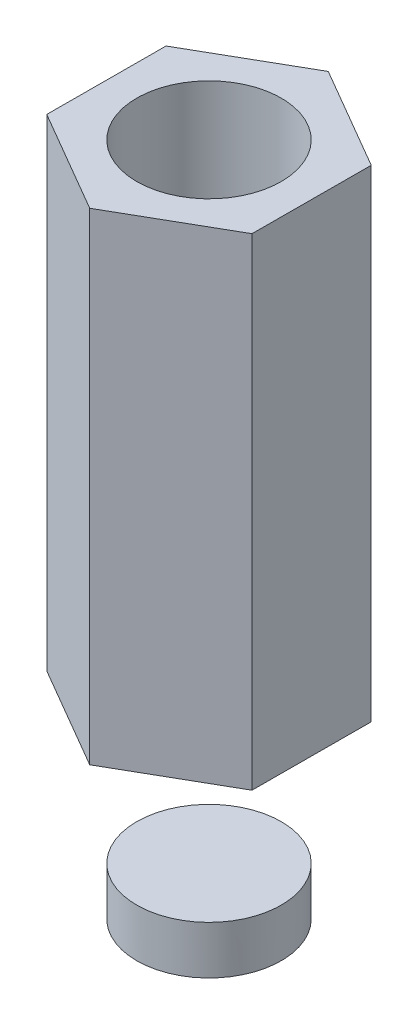
ISO-10303-21;
HEADER;
FILE_DESCRIPTION(('STEP AP214'),'2;1');
FILE_NAME('part.step','',(''),(''),'','','');
FILE_SCHEMA(('AUTOMOTIVE_DESIGN { 1 0 10303 214 1 1 1 1 }'));
ENDSEC;
DATA;
#1=APPLICATION_CONTEXT('core data for automotive mechanical design processes');
#2=APPLICATION_PROTOCOL_DEFINITION('international standard','automotive_design',2000,#1);
#3=PRODUCT_CONTEXT('',#1,'mechanical');
#4=PRODUCT('Part','Part','',(#3));
#5=PRODUCT_RELATED_PRODUCT_CATEGORY('part','',(#4));
#6=PRODUCT_DEFINITION_FORMATION('','',#4);
#7=PRODUCT_DEFINITION_CONTEXT('part definition',#1,'design');
#8=PRODUCT_DEFINITION('design','',#6,#7);
#9=PRODUCT_DEFINITION_SHAPE('','',#8);
#10=(LENGTH_UNIT() NAMED_UNIT(*) SI_UNIT(.MILLI.,.METRE.));
#11=(NAMED_UNIT(*) PLANE_ANGLE_UNIT() SI_UNIT($,.RADIAN.));
#12=(NAMED_UNIT(*) SI_UNIT($,.STERADIAN.) SOLID_ANGLE_UNIT());
#13=UNCERTAINTY_MEASURE_WITH_UNIT(LENGTH_MEASURE(1.E-05),#10,'distance_accuracy_value','');
#14=(GEOMETRIC_REPRESENTATION_CONTEXT(3) GLOBAL_UNCERTAINTY_ASSIGNED_CONTEXT((#13)) GLOBAL_UNIT_ASSIGNED_CONTEXT((#10,
#11,#12)) REPRESENTATION_CONTEXT('',''));
#15=CARTESIAN_POINT('',(0.,0.,0.));
#16=DIRECTION('',(0.,0.,1.));
#17=DIRECTION('',(1.,0.,0.));
#18=AXIS2_PLACEMENT_3D('',#15,#16,#17);
#19=CARTESIAN_POINT('',(0.,1.,0.));
#20=DIRECTION('',(0.,1.,0.));
#21=DIRECTION('',(-1.,0.,0.));
#22=AXIS2_PLACEMENT_3D('',#19,#20,#21);
#23=PLANE('',#22);
#24=CARTESIAN_POINT('',(0.,1.,0.));
#25=DIRECTION('',(0.,1.,0.));
#26=DIRECTION('',(-1.,0.,0.));
#27=AXIS2_PLACEMENT_3D('',#24,#25,#26);
#28=CIRCLE('',#27,1.5);
#29=CARTESIAN_POINT('',(-1.5,0.999999999999999,0.));
#30=VERTEX_POINT('',#29);
#31=EDGE_CURVE('E42',#30,#30,#28,.T.);
#32=ORIENTED_EDGE('',*,*,#31,.T.);
#33=EDGE_LOOP('',(#32));
#34=FACE_BOUND('',#33,.T.);
#35=ADVANCED_FACE('F39',(#34),#23,.T.);
#36=CARTESIAN_POINT('',(0.,0.,0.));
#37=DIRECTION('',(0.,1.,0.));
#38=DIRECTION('',(0.,0.,1.));
#39=AXIS2_PLACEMENT_3D('',#36,#37,#38);
#40=PLANE('',#39);
#41=CARTESIAN_POINT('',(0.,0.,0.));
#42=DIRECTION('',(0.,1.,0.));
#43=DIRECTION('',(0.,0.,1.));
#44=AXIS2_PLACEMENT_3D('',#41,#42,#43);
#45=CIRCLE('',#44,1.5);
#46=CARTESIAN_POINT('',(0.,0.,1.5));
#47=VERTEX_POINT('',#46);
#48=EDGE_CURVE('E11',#47,#47,#45,.T.);
#49=ORIENTED_EDGE('',*,*,#48,.F.);
#50=EDGE_LOOP('',(#49));
#51=FACE_BOUND('',#50,.T.);
#52=ADVANCED_FACE('F54',(#51),#40,.F.);
#53=CARTESIAN_POINT('',(0.,4.,0.));
#54=DIRECTION('',(0.,-1.,0.));
#55=DIRECTION('',(0.,0.,-1.));
#56=AXIS2_PLACEMENT_3D('',#53,#54,#55);
#57=CYLINDRICAL_SURFACE('',#56,1.5);
#58=ORIENTED_EDGE('',*,*,#48,.T.);
#59=EDGE_LOOP('',(#58));
#60=FACE_BOUND('',#59,.T.);
#61=ORIENTED_EDGE('',*,*,#31,.F.);
#62=EDGE_LOOP('',(#61));
#63=FACE_BOUND('',#62,.T.);
#64=ADVANCED_FACE('F52',(#60,#63),#57,.T.);
#65=CLOSED_SHELL('',(#35,#52,#64));
#66=MANIFOLD_SOLID_BREP('B2',#65);
#67=CARTESIAN_POINT('',(-2.13186599078324,4.,-1.24023650407198));
#68=DIRECTION('',(0.,1.,0.));
#69=DIRECTION('',(0.,0.,1.));
#70=AXIS2_PLACEMENT_3D('',#67,#68,#69);
#71=PLANE('',#70);
#72=DIRECTION('',(-0.867671547723485,0.,0.497137893618191));
#73=VECTOR('',#72,1.);
#74=CARTESIAN_POINT('',(0.00814332383552204,4.,-2.46636835751836));
#75=LINE('',#74,#73);
#76=CARTESIAN_POINT('',(0.00814332383552204,4.,-2.46636835751836));
#77=VERTEX_POINT('',#76);
#78=CARTESIAN_POINT('',(-2.13186599078324,4.,-1.24023650407198));
#79=VERTEX_POINT('',#78);
#80=EDGE_CURVE('E165',#77,#79,#75,.T.);
#81=ORIENTED_EDGE('',*,*,#80,.F.);
#82=DIRECTION('',(-0.864369818918982,0.,-0.502856655660404));
#83=VECTOR('',#82,1.);
#84=CARTESIAN_POINT('',(2.14000931461876,4.,-1.22613185344637));
#85=LINE('',#84,#83);
#86=CARTESIAN_POINT('',(2.14000931461876,4.,-1.22613185344637));
#87=VERTEX_POINT('',#86);
#88=EDGE_CURVE('E126',#87,#77,#85,.T.);
#89=ORIENTED_EDGE('',*,*,#88,.F.);
#90=DIRECTION('',(0.00330172880450263,0.,-0.999994549278596));
#91=VECTOR('',#90,1.);
#92=CARTESIAN_POINT('',(2.13186599078323,4.,1.24023650407198));
#93=LINE('',#92,#91);
#94=CARTESIAN_POINT('',(2.13186599078323,4.,1.24023650407198));
#95=VERTEX_POINT('',#94);
#96=EDGE_CURVE('E120',#95,#87,#93,.T.);
#97=ORIENTED_EDGE('',*,*,#96,.F.);
#98=DIRECTION('',(0.867671547723485,0.,-0.497137893618191));
#99=VECTOR('',#98,1.);
#100=CARTESIAN_POINT('',(-0.00814332383552226,4.,2.46636835751835));
#101=LINE('',#100,#99);
#102=CARTESIAN_POINT('',(-0.00814332383552226,4.,2.46636835751835));
#103=VERTEX_POINT('',#102);
#104=EDGE_CURVE('E155',#103,#95,#101,.T.);
#105=ORIENTED_EDGE('',*,*,#104,.F.);
#106=DIRECTION('',(0.864369818918982,0.,0.502856655660404));
#107=VECTOR('',#106,1.);
#108=CARTESIAN_POINT('',(-2.14000931461876,4.,1.22613185344637));
#109=LINE('',#108,#107);
#110=CARTESIAN_POINT('',(-2.14000931461876,4.,1.22613185344637));
#111=VERTEX_POINT('',#110);
#112=EDGE_CURVE('E171',#111,#103,#109,.T.);
#113=ORIENTED_EDGE('',*,*,#112,.F.);
#114=DIRECTION('',(-0.0033017288045028,0.,0.999994549278596));
#115=VECTOR('',#114,1.);
#116=CARTESIAN_POINT('',(-2.13186599078324,4.,-1.24023650407198));
#117=LINE('',#116,#115);
#118=EDGE_CURVE('E168',#79,#111,#117,.T.);
#119=ORIENTED_EDGE('',*,*,#118,.F.);
#120=EDGE_LOOP('',(#81,#89,#97,#105,#113,#119));
#121=FACE_BOUND('',#120,.T.);
#122=ADVANCED_FACE('F80',(#121),#71,.F.);
#123=CARTESIAN_POINT('',(0.00814332383552204,14.,-2.46636835751836));
#124=DIRECTION('',(0.497137893618191,0.,0.867671547723485));
#125=DIRECTION('',(0.867671547723485,0.,-0.497137893618191));
#126=AXIS2_PLACEMENT_3D('',#123,#124,#125);
#127=PLANE('',#126);
#128=ORIENTED_EDGE('',*,*,#80,.T.);
#129=DIRECTION('',(0.,-1.,0.));
#130=VECTOR('',#129,1.);
#131=CARTESIAN_POINT('',(-2.13186599078324,14.,-1.24023650407198));
#132=LINE('',#131,#130);
#133=CARTESIAN_POINT('',(-2.13186599078324,14.,-1.24023650407198));
#134=VERTEX_POINT('',#133);
#135=EDGE_CURVE('E37',#134,#79,#132,.T.);
#136=ORIENTED_EDGE('',*,*,#135,.F.);
#137=DIRECTION('',(-0.867671547723485,0.,0.497137893618191));
#138=VECTOR('',#137,1.);
#139=CARTESIAN_POINT('',(0.00814332383552204,14.,-2.46636835751836));
#140=LINE('',#139,#138);
#141=CARTESIAN_POINT('',(0.00814332383552204,14.,-2.46636835751836));
#142=VERTEX_POINT('',#141);
#143=EDGE_CURVE('E176',#142,#134,#140,.T.);
#144=ORIENTED_EDGE('',*,*,#143,.F.);
#145=DIRECTION('',(0.,-1.,0.));
#146=VECTOR('',#145,1.);
#147=CARTESIAN_POINT('',(0.00814332383552204,14.,-2.46636835751836));
#148=LINE('',#147,#146);
#149=EDGE_CURVE('E161',#142,#77,#148,.T.);
#150=ORIENTED_EDGE('',*,*,#149,.T.);
#151=EDGE_LOOP('',(#128,#136,#144,#150));
#152=FACE_BOUND('',#151,.T.);
#153=ADVANCED_FACE('F82',(#152),#127,.F.);
#154=CARTESIAN_POINT('',(-2.13186599078324,14.,-1.24023650407198));
#155=DIRECTION('',(0.999994549278596,0.,0.0033017288045028));
#156=DIRECTION('',(0.0033017288045028,0.,-0.999994549278596));
#157=AXIS2_PLACEMENT_3D('',#154,#155,#156);
#158=PLANE('',#157);
#159=ORIENTED_EDGE('',*,*,#118,.T.);
#160=DIRECTION('',(0.,-1.,0.));
#161=VECTOR('',#160,1.);
#162=CARTESIAN_POINT('',(-2.14000931461876,14.,1.22613185344637));
#163=LINE('',#162,#161);
#164=CARTESIAN_POINT('',(-2.14000931461876,14.,1.22613185344637));
#165=VERTEX_POINT('',#164);
#166=EDGE_CURVE('E89',#165,#111,#163,.T.);
#167=ORIENTED_EDGE('',*,*,#166,.F.);
#168=DIRECTION('',(-0.0033017288045028,0.,0.999994549278596));
#169=VECTOR('',#168,1.);
#170=CARTESIAN_POINT('',(-2.13186599078324,14.,-1.24023650407198));
#171=LINE('',#170,#169);
#172=EDGE_CURVE('E134',#134,#165,#171,.T.);
#173=ORIENTED_EDGE('',*,*,#172,.F.);
#174=ORIENTED_EDGE('',*,*,#135,.T.);
#175=EDGE_LOOP('',(#159,#167,#173,#174));
#176=FACE_BOUND('',#175,.T.);
#177=ADVANCED_FACE('F204',(#176),#158,.F.);
#178=CARTESIAN_POINT('',(-2.14000931461876,14.,1.22613185344637));
#179=DIRECTION('',(0.502856655660404,0.,-0.864369818918982));
#180=DIRECTION('',(-0.864369818918982,0.,-0.502856655660404));
#181=AXIS2_PLACEMENT_3D('',#178,#179,#180);
#182=PLANE('',#181);
#183=ORIENTED_EDGE('',*,*,#112,.T.);
#184=DIRECTION('',(0.,-1.,0.));
#185=VECTOR('',#184,1.);
#186=CARTESIAN_POINT('',(-0.00814332383552226,14.,2.46636835751835));
#187=LINE('',#186,#185);
#188=CARTESIAN_POINT('',(-0.00814332383552226,14.,2.46636835751835));
#189=VERTEX_POINT('',#188);
#190=EDGE_CURVE('E156',#189,#103,#187,.T.);
#191=ORIENTED_EDGE('',*,*,#190,.F.);
#192=DIRECTION('',(0.864369818918982,0.,0.502856655660404));
#193=VECTOR('',#192,1.);
#194=CARTESIAN_POINT('',(-2.14000931461876,14.,1.22613185344637));
#195=LINE('',#194,#193);
#196=EDGE_CURVE('E147',#165,#189,#195,.T.);
#197=ORIENTED_EDGE('',*,*,#196,.F.);
#198=ORIENTED_EDGE('',*,*,#166,.T.);
#199=EDGE_LOOP('',(#183,#191,#197,#198));
#200=FACE_BOUND('',#199,.T.);
#201=ADVANCED_FACE('F182',(#200),#182,.F.);
#202=CARTESIAN_POINT('',(-0.00814332383552226,14.,2.46636835751835));
#203=DIRECTION('',(-0.497137893618191,0.,-0.867671547723485));
#204=DIRECTION('',(-0.867671547723485,0.,0.497137893618191));
#205=AXIS2_PLACEMENT_3D('',#202,#203,#204);
#206=PLANE('',#205);
#207=ORIENTED_EDGE('',*,*,#104,.T.);
#208=DIRECTION('',(0.,-1.,0.));
#209=VECTOR('',#208,1.);
#210=CARTESIAN_POINT('',(2.13186599078323,14.,1.24023650407198));
#211=LINE('',#210,#209);
#212=CARTESIAN_POINT('',(2.13186599078323,14.,1.24023650407198));
#213=VERTEX_POINT('',#212);
#214=EDGE_CURVE('E152',#213,#95,#211,.T.);
#215=ORIENTED_EDGE('',*,*,#214,.F.);
#216=DIRECTION('',(0.867671547723485,0.,-0.497137893618191));
#217=VECTOR('',#216,1.);
#218=CARTESIAN_POINT('',(-0.00814332383552226,14.,2.46636835751835));
#219=LINE('',#218,#217);
#220=EDGE_CURVE('E141',#189,#213,#219,.T.);
#221=ORIENTED_EDGE('',*,*,#220,.F.);
#222=ORIENTED_EDGE('',*,*,#190,.T.);
#223=EDGE_LOOP('',(#207,#215,#221,#222));
#224=FACE_BOUND('',#223,.T.);
#225=ADVANCED_FACE('F153',(#224),#206,.F.);
#226=CARTESIAN_POINT('',(2.13186599078323,14.,1.24023650407198));
#227=DIRECTION('',(-0.999994549278596,0.,-0.00330172880450263));
#228=DIRECTION('',(-0.00330172880450263,0.,0.999994549278596));
#229=AXIS2_PLACEMENT_3D('',#226,#227,#228);
#230=PLANE('',#229);
#231=ORIENTED_EDGE('',*,*,#96,.T.);
#232=DIRECTION('',(0.,-1.,0.));
#233=VECTOR('',#232,1.);
#234=CARTESIAN_POINT('',(2.14000931461876,14.,-1.22613185344637));
#235=LINE('',#234,#233);
#236=CARTESIAN_POINT('',(2.14000931461876,14.,-1.22613185344637));
#237=VERTEX_POINT('',#236);
#238=EDGE_CURVE('E157',#237,#87,#235,.T.);
#239=ORIENTED_EDGE('',*,*,#238,.F.);
#240=DIRECTION('',(0.00330172880450263,0.,-0.999994549278596));
#241=VECTOR('',#240,1.);
#242=CARTESIAN_POINT('',(2.13186599078323,14.,1.24023650407198));
#243=LINE('',#242,#241);
#244=EDGE_CURVE('E145',#213,#237,#243,.T.);
#245=ORIENTED_EDGE('',*,*,#244,.F.);
#246=ORIENTED_EDGE('',*,*,#214,.T.);
#247=EDGE_LOOP('',(#231,#239,#245,#246));
#248=FACE_BOUND('',#247,.T.);
#249=ADVANCED_FACE('F159',(#248),#230,.F.);
#250=CARTESIAN_POINT('',(2.14000931461876,14.,-1.22613185344637));
#251=DIRECTION('',(-0.502856655660405,0.,0.864369818918982));
#252=DIRECTION('',(0.864369818918982,0.,0.502856655660405));
#253=AXIS2_PLACEMENT_3D('',#250,#251,#252);
#254=PLANE('',#253);
#255=ORIENTED_EDGE('',*,*,#88,.T.);
#256=ORIENTED_EDGE('',*,*,#149,.F.);
#257=DIRECTION('',(-0.864369818918982,0.,-0.502856655660404));
#258=VECTOR('',#257,1.);
#259=CARTESIAN_POINT('',(2.14000931461876,14.,-1.22613185344637));
#260=LINE('',#259,#258);
#261=EDGE_CURVE('E97',#237,#142,#260,.T.);
#262=ORIENTED_EDGE('',*,*,#261,.F.);
#263=ORIENTED_EDGE('',*,*,#238,.T.);
#264=EDGE_LOOP('',(#255,#256,#262,#263));
#265=FACE_BOUND('',#264,.T.);
#266=ADVANCED_FACE('F188',(#265),#254,.F.);
#267=CARTESIAN_POINT('',(-2.13186599078324,14.,-1.24023650407198));
#268=DIRECTION('',(0.,1.,0.));
#269=DIRECTION('',(0.,0.,1.));
#270=AXIS2_PLACEMENT_3D('',#267,#268,#269);
#271=PLANE('',#270);
#272=CARTESIAN_POINT('',(0.,14.,0.));
#273=DIRECTION('',(0.,1.,0.));
#274=DIRECTION('',(0.,0.,1.));
#275=AXIS2_PLACEMENT_3D('',#272,#273,#274);
#276=CIRCLE('',#275,1.5);
#277=CARTESIAN_POINT('',(0.,14.,1.5));
#278=VERTEX_POINT('',#277);
#279=EDGE_CURVE('E216',#278,#278,#276,.T.);
#280=ORIENTED_EDGE('',*,*,#279,.F.);
#281=EDGE_LOOP('',(#280));
#282=FACE_BOUND('',#281,.T.);
#283=ORIENTED_EDGE('',*,*,#143,.T.);
#284=ORIENTED_EDGE('',*,*,#172,.T.);
#285=ORIENTED_EDGE('',*,*,#196,.T.);
#286=ORIENTED_EDGE('',*,*,#220,.T.);
#287=ORIENTED_EDGE('',*,*,#244,.T.);
#288=ORIENTED_EDGE('',*,*,#261,.T.);
#289=EDGE_LOOP('',(#283,#284,#285,#286,#287,#288));
#290=FACE_BOUND('',#289,.T.);
#291=ADVANCED_FACE('F143',(#282,#290),#271,.T.);
#292=CARTESIAN_POINT('',(0.,10.,0.));
#293=DIRECTION('',(0.,1.,0.));
#294=DIRECTION('',(0.,0.,1.));
#295=AXIS2_PLACEMENT_3D('',#292,#293,#294);
#296=CYLINDRICAL_SURFACE('',#295,1.5);
#297=CARTESIAN_POINT('',(0.,10.,0.));
#298=DIRECTION('',(0.,1.,0.));
#299=DIRECTION('',(0.,0.,1.));
#300=AXIS2_PLACEMENT_3D('',#297,#298,#299);
#301=CIRCLE('',#300,1.5);
#302=CARTESIAN_POINT('',(0.,10.,1.5));
#303=VERTEX_POINT('',#302);
#304=EDGE_CURVE('E169',#303,#303,#301,.T.);
#305=ORIENTED_EDGE('',*,*,#304,.F.);
#306=EDGE_LOOP('',(#305));
#307=FACE_BOUND('',#306,.T.);
#308=ORIENTED_EDGE('',*,*,#279,.T.);
#309=EDGE_LOOP('',(#308));
#310=FACE_BOUND('',#309,.T.);
#311=ADVANCED_FACE('F195',(#307,#310),#296,.F.);
#312=CARTESIAN_POINT('',(0.,10.,0.));
#313=DIRECTION('',(0.,1.,0.));
#314=DIRECTION('',(0.,0.,1.));
#315=AXIS2_PLACEMENT_3D('',#312,#313,#314);
#316=PLANE('',#315);
#317=ORIENTED_EDGE('',*,*,#304,.T.);
#318=EDGE_LOOP('',(#317));
#319=FACE_BOUND('',#318,.T.);
#320=ADVANCED_FACE('F208',(#319),#316,.T.);
#321=CLOSED_SHELL('',(#122,#153,#177,#201,#225,#249,#266,#291,#311,#320));
#322=MANIFOLD_SOLID_BREP('B6',#321);
#323=ADVANCED_BREP_SHAPE_REPRESENTATION('',(#18,#66,#322),#14);
#324=SHAPE_DEFINITION_REPRESENTATION(#9,#323);
ENDSEC;
END-ISO-10303-21;
